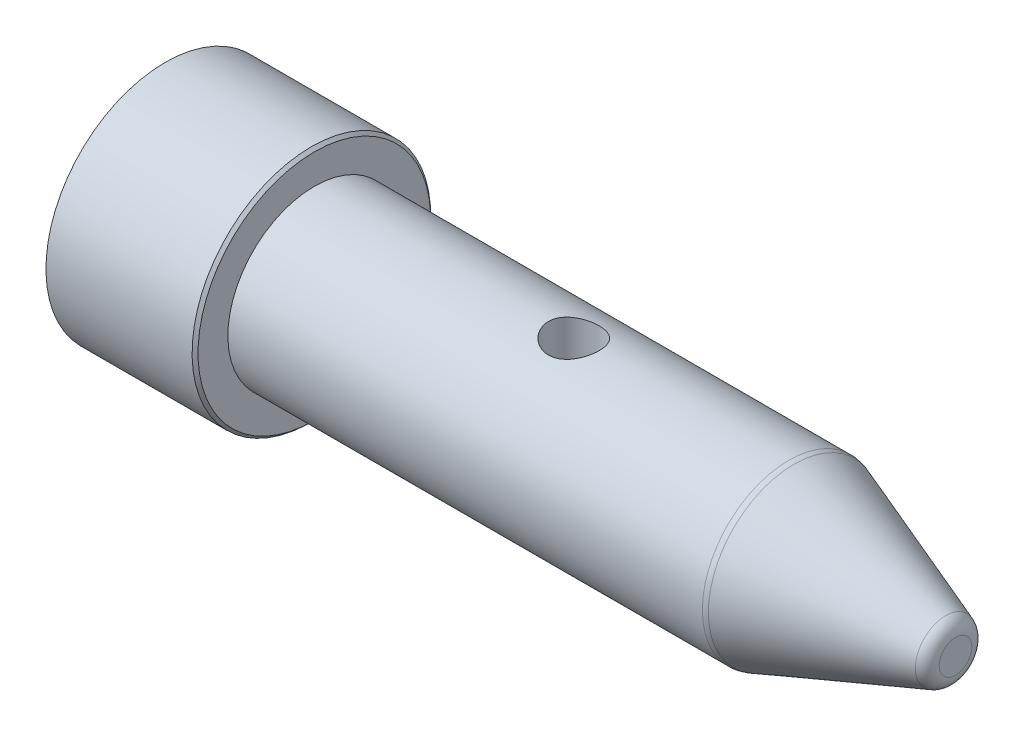
ISO-10303-21;
HEADER;
FILE_DESCRIPTION(('STEP AP214'),'2;1');
FILE_NAME('part.step','',(''),(''),'','','');
FILE_SCHEMA(('AUTOMOTIVE_DESIGN { 1 0 10303 214 1 1 1 1 }'));
ENDSEC;
DATA;
#1=APPLICATION_CONTEXT('core data for automotive mechanical design processes');
#2=APPLICATION_PROTOCOL_DEFINITION('international standard','automotive_design',2000,#1);
#3=PRODUCT_CONTEXT('',#1,'mechanical');
#4=PRODUCT('Part','Part','',(#3));
#5=PRODUCT_RELATED_PRODUCT_CATEGORY('part','',(#4));
#6=PRODUCT_DEFINITION_FORMATION('','',#4);
#7=PRODUCT_DEFINITION_CONTEXT('part definition',#1,'design');
#8=PRODUCT_DEFINITION('design','',#6,#7);
#9=PRODUCT_DEFINITION_SHAPE('','',#8);
#10=(LENGTH_UNIT() NAMED_UNIT(*) SI_UNIT(.MILLI.,.METRE.));
#11=(NAMED_UNIT(*) PLANE_ANGLE_UNIT() SI_UNIT($,.RADIAN.));
#12=(NAMED_UNIT(*) SI_UNIT($,.STERADIAN.) SOLID_ANGLE_UNIT());
#13=UNCERTAINTY_MEASURE_WITH_UNIT(LENGTH_MEASURE(1.E-05),#10,'distance_accuracy_value','');
#14=(GEOMETRIC_REPRESENTATION_CONTEXT(3) GLOBAL_UNCERTAINTY_ASSIGNED_CONTEXT((#13)) GLOBAL_UNIT_ASSIGNED_CONTEXT((#10,
#11,#12)) REPRESENTATION_CONTEXT('',''));
#15=CARTESIAN_POINT('',(0.,0.,0.));
#16=DIRECTION('',(0.,0.,1.));
#17=DIRECTION('',(1.,0.,0.));
#18=AXIS2_PLACEMENT_3D('',#15,#16,#17);
#19=CARTESIAN_POINT('',(0.,10.,0.));
#20=DIRECTION('',(-1.,0.,0.));
#21=DIRECTION('',(0.,-1.,0.));
#22=AXIS2_PLACEMENT_3D('',#19,#20,#21);
#23=PLANE('',#22);
#24=CARTESIAN_POINT('',(0.,0.,0.));
#25=DIRECTION('',(1.,0.,0.));
#26=DIRECTION('',(0.,1.,0.));
#27=AXIS2_PLACEMENT_3D('',#24,#25,#26);
#28=CIRCLE('',#27,10.);
#29=CARTESIAN_POINT('',(0.,10.,0.));
#30=VERTEX_POINT('',#29);
#31=EDGE_CURVE('E147',#30,#30,#28,.T.);
#32=ORIENTED_EDGE('',*,*,#31,.T.);
#33=EDGE_LOOP('',(#32));
#34=FACE_BOUND('',#33,.T.);
#35=CARTESIAN_POINT('',(0.,0.,0.));
#36=DIRECTION('',(1.,0.,0.));
#37=DIRECTION('',(0.,1.,0.));
#38=AXIS2_PLACEMENT_3D('',#35,#36,#37);
#39=CIRCLE('',#38,40.);
#40=CARTESIAN_POINT('',(0.,40.,0.));
#41=VERTEX_POINT('',#40);
#42=EDGE_CURVE('E138',#41,#41,#39,.T.);
#43=ORIENTED_EDGE('',*,*,#42,.F.);
#44=EDGE_LOOP('',(#43));
#45=FACE_BOUND('',#44,.T.);
#46=ADVANCED_FACE('F46',(#34,#45),#23,.T.);
#47=CARTESIAN_POINT('',(265.,0.,0.));
#48=DIRECTION('',(1.,0.,0.));
#49=DIRECTION('',(0.,1.,0.));
#50=AXIS2_PLACEMENT_3D('',#47,#48,#49);
#51=CYLINDRICAL_SURFACE('',#50,40.);
#52=CARTESIAN_POINT('',(49.,0.,0.));
#53=DIRECTION('',(1.,0.,0.));
#54=DIRECTION('',(0.,1.,0.));
#55=AXIS2_PLACEMENT_3D('',#52,#53,#54);
#56=CIRCLE('',#55,40.);
#57=CARTESIAN_POINT('',(49.,40.,0.));
#58=VERTEX_POINT('',#57);
#59=EDGE_CURVE('E129',#58,#58,#56,.F.);
#60=ORIENTED_EDGE('',*,*,#59,.T.);
#61=EDGE_LOOP('',(#60));
#62=FACE_BOUND('',#61,.T.);
#63=ORIENTED_EDGE('',*,*,#42,.T.);
#64=EDGE_LOOP('',(#63));
#65=FACE_BOUND('',#64,.T.);
#66=ADVANCED_FACE('F104',(#62,#65),#51,.T.);
#67=CARTESIAN_POINT('',(50.,39.9999999999999,0.));
#68=DIRECTION('',(1.,0.,0.));
#69=DIRECTION('',(0.,1.,0.));
#70=AXIS2_PLACEMENT_3D('',#67,#68,#69);
#71=PLANE('',#70);
#72=CARTESIAN_POINT('',(50.,-1.11022302462516E-13,0.));
#73=DIRECTION('',(1.,0.,0.));
#74=DIRECTION('',(0.,1.,0.));
#75=AXIS2_PLACEMENT_3D('',#72,#73,#74);
#76=CIRCLE('',#75,39.);
#77=CARTESIAN_POINT('',(50.,38.9999999999999,0.));
#78=VERTEX_POINT('',#77);
#79=EDGE_CURVE('E133',#78,#78,#76,.T.);
#80=ORIENTED_EDGE('',*,*,#79,.T.);
#81=EDGE_LOOP('',(#80));
#82=FACE_BOUND('',#81,.T.);
#83=CARTESIAN_POINT('',(50.,-1.11022302462516E-13,0.));
#84=DIRECTION('',(1.,0.,0.));
#85=DIRECTION('',(0.,1.,0.));
#86=AXIS2_PLACEMENT_3D('',#83,#84,#85);
#87=CIRCLE('',#86,29.);
#88=CARTESIAN_POINT('',(50.,28.9999999999999,0.));
#89=VERTEX_POINT('',#88);
#90=EDGE_CURVE('E141',#89,#89,#87,.T.);
#91=ORIENTED_EDGE('',*,*,#90,.F.);
#92=EDGE_LOOP('',(#91));
#93=FACE_BOUND('',#92,.T.);
#94=ADVANCED_FACE('F100',(#82,#93),#71,.T.);
#95=CARTESIAN_POINT('',(265.,0.,0.));
#96=DIRECTION('',(1.,0.,0.));
#97=DIRECTION('',(0.,1.,0.));
#98=AXIS2_PLACEMENT_3D('',#95,#96,#97);
#99=CYLINDRICAL_SURFACE('',#98,29.);
#100=CARTESIAN_POINT('',(128.5,28.9999999999999,0.));
#101=CARTESIAN_POINT('',(128.500000546186,28.9999996549336,0.233407123480568));
#102=CARTESIAN_POINT('',(128.509621873939,28.9971753703689,0.466824046245444));
#103=CARTESIAN_POINT('',(128.548021828591,28.9859552532089,0.931947947448221));
#104=CARTESIAN_POINT('',(128.576801526834,28.9775591090334,1.16365482952741));
#105=CARTESIAN_POINT('',(128.653264147547,28.9554254275635,1.62369206607447));
#106=CARTESIAN_POINT('',(128.700949025098,28.9416873378343,1.85202206878809));
#107=CARTESIAN_POINT('',(128.814827729385,28.9092384629732,2.30374308350369));
#108=CARTESIAN_POINT('',(128.88102840015,28.8905258392216,2.5271322362));
#109=CARTESIAN_POINT('',(129.031239513367,28.8486733555531,2.96694425489711));
#110=CARTESIAN_POINT('',(129.115216939276,28.825541710691,3.18337919019352));
#111=CARTESIAN_POINT('',(129.300425869486,28.775432144505,3.60836660488911));
#112=CARTESIAN_POINT('',(129.401663857023,28.7484527785644,3.81691608634153));
#113=CARTESIAN_POINT('',(129.620582018012,28.6913689363075,4.22465598495828));
#114=CARTESIAN_POINT('',(129.738256750982,28.6612654948888,4.42384946987775));
#115=CARTESIAN_POINT('',(129.98930618345,28.5986896202888,4.8118172750308));
#116=CARTESIAN_POINT('',(130.122688075951,28.566216104354,5.00058676307381));
#117=CARTESIAN_POINT('',(130.407720820393,28.498921004363,5.37101620833636));
#118=CARTESIAN_POINT('',(130.559742628774,28.4640611657005,5.55238385943118));
#119=CARTESIAN_POINT('',(130.87823082827,28.3936956565434,5.90167608201912));
#120=CARTESIAN_POINT('',(131.044691098134,28.3581902647314,6.06960629288614));
#121=CARTESIAN_POINT('',(131.391150457701,28.2874605880499,6.39114165796495));
#122=CARTESIAN_POINT('',(131.571157083712,28.2522364718976,6.54473873012392));
#123=CARTESIAN_POINT('',(131.943430316122,28.1830705387736,6.83644666622982));
#124=CARTESIAN_POINT('',(132.135692333141,28.1491282492804,6.97456327445029));
#125=CARTESIAN_POINT('',(132.535646553136,28.082747947805,7.23726659366598));
#126=CARTESIAN_POINT('',(132.743583516645,28.0503587553941,7.36149339856154));
#127=CARTESIAN_POINT('',(133.169600248517,27.9888828241316,7.59188090939718));
#128=CARTESIAN_POINT('',(133.387676017453,27.9597947984001,7.69804866332852));
#129=CARTESIAN_POINT('',(133.832553593136,27.9058054090053,7.89152199999591));
#130=CARTESIAN_POINT('',(134.059355633816,27.8809041576771,7.97882707664658));
#131=CARTESIAN_POINT('',(134.52004778386,27.8360848789715,8.13381183484407));
#132=CARTESIAN_POINT('',(134.753937653033,27.81616668294,8.20149218061242));
#133=CARTESIAN_POINT('',(135.220699589223,27.7824259716945,8.31506004139202));
#134=CARTESIAN_POINT('',(135.453430422735,27.7684541708684,8.36148381512638));
#135=CARTESIAN_POINT('',(135.922230127323,27.7462930369768,8.43473130768077));
#136=CARTESIAN_POINT('',(136.158298943669,27.7381036092131,8.46155534748715));
#137=CARTESIAN_POINT('',(136.631938518169,27.7277735171446,8.49534515358358));
#138=CARTESIAN_POINT('',(136.869508966852,27.7256316447788,8.50231488597677));
#139=CARTESIAN_POINT('',(137.344372985741,27.7274633589698,8.496339605202));
#140=CARTESIAN_POINT('',(137.581666561485,27.7314368210196,8.48339499748647));
#141=CARTESIAN_POINT('',(138.045996178192,27.745127785307,8.43850740039411));
#142=CARTESIAN_POINT('',(138.273103507491,27.7546422334803,8.40723577568916));
#143=CARTESIAN_POINT('',(138.723857455316,27.7789671847404,8.32650932197573));
#144=CARTESIAN_POINT('',(138.947502808986,27.793779577946,8.27704800335211));
#145=CARTESIAN_POINT('',(139.389654570401,27.8282568297051,8.1603808062212));
#146=CARTESIAN_POINT('',(139.608162525114,27.8479202064969,8.09318034580179));
#147=CARTESIAN_POINT('',(140.038758217144,27.8915425991625,7.94154092211577));
#148=CARTESIAN_POINT('',(140.250843497455,27.9155032352917,7.85709545505345));
#149=CARTESIAN_POINT('',(140.669842911701,27.9673733299231,7.67043197775387));
#150=CARTESIAN_POINT('',(140.876655925778,27.9953294646077,7.5680000478816));
#151=CARTESIAN_POINT('',(141.281022658023,28.0541818612825,7.34683418289115));
#152=CARTESIAN_POINT('',(141.47857316804,28.0850791308961,7.22809465462835));
#153=CARTESIAN_POINT('',(141.863155895833,28.1489666238407,6.97514786592083));
#154=CARTESIAN_POINT('',(142.050187867759,28.1819568960532,6.84094024416316));
#155=CARTESIAN_POINT('',(142.412625601819,28.2491556723137,6.55792292779995));
#156=CARTESIAN_POINT('',(142.588031049815,28.2833642092398,6.4091128389179));
#157=CARTESIAN_POINT('',(142.932941660012,28.3534857029891,6.09157802154538));
#158=CARTESIAN_POINT('',(143.101930499573,28.3894121204204,5.92229493930115));
#159=CARTESIAN_POINT('',(143.425054021001,28.4606128679971,5.57007900285313));
#160=CARTESIAN_POINT('',(143.579193500685,28.4958874057674,5.38715059156913));
#161=CARTESIAN_POINT('',(143.871707314151,28.5648410573415,5.00867872979229));
#162=CARTESIAN_POINT('',(144.010074749587,28.5985194693014,4.81312981748848));
#163=CARTESIAN_POINT('',(144.269932194798,28.6633229594507,4.41082820919168));
#164=CARTESIAN_POINT('',(144.391428810864,28.6944490351201,4.20407994298767));
#165=CARTESIAN_POINT('',(144.617437165209,28.7534931151095,3.77927427525336));
#166=CARTESIAN_POINT('',(144.721831625924,28.7813886126998,3.56115129248575));
#167=CARTESIAN_POINT('',(144.911769563166,28.8329280641793,3.11646159475602));
#168=CARTESIAN_POINT('',(144.997320640151,28.8565737315225,2.88989832744409));
#169=CARTESIAN_POINT('',(145.148885701692,28.898945305987,2.42987805600162));
#170=CARTESIAN_POINT('',(145.214899874197,28.9176712604369,2.19642111821356));
#171=CARTESIAN_POINT('',(145.326788248178,28.9496549775915,1.72436376015886));
#172=CARTESIAN_POINT('',(145.372663148826,28.9629129301266,1.485763518753));
#173=CARTESIAN_POINT('',(145.442615063159,28.9832135993502,1.0135340225873));
#174=CARTESIAN_POINT('',(145.467387633293,28.9904544299864,0.780016113203966));
#175=CARTESIAN_POINT('',(145.497526645988,28.9992715264576,0.311626455040997));
#176=CARTESIAN_POINT('',(145.502893533849,29.0008479222737,0.0767547374508936));
#177=CARTESIAN_POINT('',(145.494172747898,28.9982922626132,-0.392567679403727));
#178=CARTESIAN_POINT('',(145.480087311458,28.9941608636377,-0.627018423982383));
#179=CARTESIAN_POINT('',(145.432595290471,28.9803062127712,-1.09378580846319));
#180=CARTESIAN_POINT('',(145.399188832421,28.9705829974909,-1.32610246232743));
#181=CARTESIAN_POINT('',(145.314286008299,28.9460833449889,-1.78191688202809));
#182=CARTESIAN_POINT('',(145.263196357636,28.9314207023419,-2.00549672196439));
#183=CARTESIAN_POINT('',(145.143217679,28.8973819961682,-2.44754476285463));
#184=CARTESIAN_POINT('',(145.074322269979,28.8780042430335,-2.66601110061045));
#185=CARTESIAN_POINT('',(144.919313679258,28.8350479280364,-3.09624619387949));
#186=CARTESIAN_POINT('',(144.833205359804,28.8114705526738,-3.30801682125376));
#187=CARTESIAN_POINT('',(144.644376341534,28.7607061937744,-3.72365898809571));
#188=CARTESIAN_POINT('',(144.541649387741,28.7335178518225,-3.927527517391));
#189=CARTESIAN_POINT('',(144.317896060244,28.675593668049,-4.3304343586328));
#190=CARTESIAN_POINT('',(144.196515976863,28.6447927967032,-4.52926688871535));
#191=CARTESIAN_POINT('',(143.938001215657,28.5809407177656,-4.91612477827079));
#192=CARTESIAN_POINT('',(143.800861090193,28.5478887336686,-5.10414636692045));
#193=CARTESIAN_POINT('',(143.511764020521,28.4804023800766,-5.46817658795967));
#194=CARTESIAN_POINT('',(143.359806465932,28.4459679536683,-5.6441847249652));
#195=CARTESIAN_POINT('',(143.042041263077,28.3766140634962,-5.98311818269833));
#196=CARTESIAN_POINT('',(142.87623336542,28.3416945910079,-6.1460432677469));
#197=CARTESIAN_POINT('',(142.525787115753,28.271078147994,-6.46323878961647));
#198=CARTESIAN_POINT('',(142.340694384493,28.2353963820992,-6.61701106637589));
#199=CARTESIAN_POINT('',(141.958027483583,28.1655226894125,-6.90838459845248));
#200=CARTESIAN_POINT('',(141.760457569275,28.1313302613329,-7.0459913217233));
#201=CARTESIAN_POINT('',(141.353981065955,28.0654044454112,-7.30416576352272));
#202=CARTESIAN_POINT('',(141.145070261736,28.0336719826827,-7.4247270857321));
#203=CARTESIAN_POINT('',(140.717451506367,27.9736422587994,-7.64778934178577));
#204=CARTESIAN_POINT('',(140.498747613372,27.9453435924235,-7.75029767130664));
#205=CARTESIAN_POINT('',(140.053999350049,27.8931600732431,-7.93605016717663));
#206=CARTESIAN_POINT('',(139.827993778017,27.8692553363683,-8.01938157066215));
#207=CARTESIAN_POINT('',(139.369376857938,27.8264595932476,-8.16664136531243));
#208=CARTESIAN_POINT('',(139.136768134916,27.8075666246798,-8.23057735202569));
#209=CARTESIAN_POINT('',(138.666601045491,27.7753949473805,-8.338501767769));
#210=CARTESIAN_POINT('',(138.429043050463,27.7621158189887,-8.3824916878773));
#211=CARTESIAN_POINT('',(137.950790103046,27.7416102347007,-8.45010746263584));
#212=CARTESIAN_POINT('',(137.710095263506,27.7343835616726,-8.47373404782134));
#213=CARTESIAN_POINT('',(137.237074630177,27.7263867132954,-8.49986195563245));
#214=CARTESIAN_POINT('',(137.004796992219,27.7253710310693,-8.50316659116));
#215=CARTESIAN_POINT('',(136.540799192943,27.7291732628715,-8.49075929937917));
#216=CARTESIAN_POINT('',(136.309079024031,27.7339910969734,-8.47504763261763));
#217=CARTESIAN_POINT('',(135.847900706147,27.7493102081526,-8.4247534397304));
#218=CARTESIAN_POINT('',(135.618442445773,27.7598112038899,-8.39017184774322));
#219=CARTESIAN_POINT('',(135.163417170383,27.7861735972914,-8.30244845195464));
#220=CARTESIAN_POINT('',(134.937850174064,27.8020350207036,-8.24930655900175));
#221=CARTESIAN_POINT('',(134.494746318957,27.83842838932,-8.12563870016682));
#222=CARTESIAN_POINT('',(134.277146867189,27.8589043879952,-8.0553201885309));
#223=CARTESIAN_POINT('',(133.84862763173,27.9040450070428,-7.89753143020307));
#224=CARTESIAN_POINT('',(133.637710117237,27.928711032642,-7.81005542780483));
#225=CARTESIAN_POINT('',(133.223961465083,27.9815360850759,-7.61862784077982));
#226=CARTESIAN_POINT('',(133.021129948887,28.0096949481439,-7.51467702853489));
#227=CARTESIAN_POINT('',(132.624754295359,28.0687434222829,-7.29102288534986));
#228=CARTESIAN_POINT('',(132.431210696527,28.0996331913932,-7.17131864255206));
#229=CARTESIAN_POINT('',(132.047966477031,28.1644408249692,-6.91250170761517));
#230=CARTESIAN_POINT('',(131.858636536739,28.198426787151,-6.77285693825449));
#231=CARTESIAN_POINT('',(131.492315657005,28.267511788071,-6.47847434657095));
#232=CARTESIAN_POINT('',(131.31532495275,28.3026108480062,-6.3237362367045));
#233=CARTESIAN_POINT('',(130.974734837246,28.372980897627,-6.00011463390683));
#234=CARTESIAN_POINT('',(130.811138826484,28.4082519285773,-5.83122757088738));
#235=CARTESIAN_POINT('',(130.498426397509,28.4780129761215,-5.4803976525676));
#236=CARTESIAN_POINT('',(130.349309732225,28.5125030060346,-5.2984550201366));
#237=CARTESIAN_POINT('',(130.062606871881,28.5807189692741,-4.91741655067733));
#238=CARTESIAN_POINT('',(129.92545509714,28.6143971907376,-4.71798495464802));
#239=CARTESIAN_POINT('',(129.668527106794,28.6789998873273,-4.30790288358044));
#240=CARTESIAN_POINT('',(129.548744574823,28.7099253619084,-4.09725652510653));
#241=CARTESIAN_POINT('',(129.327451699819,28.768152539873,-3.66615515307947));
#242=CARTESIAN_POINT('',(129.225937046041,28.7954550977704,-3.4457024689184));
#243=CARTESIAN_POINT('',(129.041993348319,28.8456588234481,-2.99650103035319));
#244=CARTESIAN_POINT('',(128.959562303345,28.8685604526492,-2.76775314866165));
#245=CARTESIAN_POINT('',(128.823159182113,28.9068672912566,-2.33133657816601));
#246=CARTESIAN_POINT('',(128.766965063544,28.9228408962997,-2.12440912276008));
#247=CARTESIAN_POINT('',(128.670331692751,28.9504961315579,-1.70663006549185));
#248=CARTESIAN_POINT('',(128.629891460013,28.9621780288842,-1.49577870870722));
#249=CARTESIAN_POINT('',(128.565062792238,28.9809800019341,-1.07140601709728));
#250=CARTESIAN_POINT('',(128.54067538519,28.9880997855085,-0.857884512173156));
#251=CARTESIAN_POINT('',(128.508146461558,28.9976091502462,-0.429577805716462));
#252=CARTESIAN_POINT('',(128.499999497372,29.0000003175474,-0.214793052175163));
#253=CARTESIAN_POINT('',(128.5,28.9999999999999,0.));
#254=B_SPLINE_CURVE_WITH_KNOTS('',3,(#100,#101,#102,#103,#104,#105,#106,#107,#108,#109,#110,
#111,#112,#113,#114,#115,#116,#117,#118,#119,#120,#121,#122,#123,#124,#125,#126,#127,#128,#129,
#130,#131,#132,#133,#134,#135,#136,#137,#138,#139,#140,#141,#142,#143,#144,#145,#146,#147,#148,
#149,#150,#151,#152,#153,#154,#155,#156,#157,#158,#159,#160,#161,#162,#163,#164,#165,#166,#167,
#168,#169,#170,#171,#172,#173,#174,#175,#176,#177,#178,#179,#180,#181,#182,#183,#184,#185,#186,
#187,#188,#189,#190,#191,#192,#193,#194,#195,#196,#197,#198,#199,#200,#201,#202,#203,#204,#205,
#206,#207,#208,#209,#210,#211,#212,#213,#214,#215,#216,#217,#218,#219,#220,#221,#222,#223,#224,
#225,#226,#227,#228,#229,#230,#231,#232,#233,#234,#235,#236,#237,#238,#239,#240,#241,#242,#243,
#244,#245,#246,#247,#248,#249,#250,#251,#252,#253),.UNSPECIFIED.,.T.,.F.,(4,2,2,2,2,2,2,2,2,2,2,
2,2,2,2,2,2,2,2,2,2,2,2,2,2,2,2,2,2,2,2,2,2,2,2,2,2,2,2,2,2,2,2,2,2,2,2,2,2,2,2,2,2,2,2,2,2,2,2,
2,2,2,2,2,2,2,2,2,2,2,2,2,2,2,2,2,4),(0.,0.700023918254287,1.40008698536143,2.10022246842664,
2.8006170867045,3.4997221085801,4.19909030195856,4.89822755404779,5.59768622631641,
6.31448675889941,7.0309848721516,7.74788458761043,8.46451739907181,9.19674772170985,
9.92869161439936,10.6606551426959,11.3925938939551,12.1048835763169,12.8171615931944,
13.529297315194,14.2414185384291,14.9289532076528,15.6167334099179,16.3043037852049,
16.9921339518246,17.6887800936379,18.3856657691126,19.0825677261587,19.7794885052101,
20.5042743131419,21.2288251523043,21.9536916878371,22.6782735742244,23.4076332173444,
24.1366981330681,24.8657560347908,25.5947886239579,26.2987426617907,27.0026805459807,
27.7065374711585,28.4103897881304,29.0990249403974,29.7879072218439,30.4765951844,
31.1655429632747,31.8696897251975,32.5740806197774,33.2785005429378,33.9829331527239,
34.7118683719469,35.4405563165769,36.1695169810906,36.8981783178441,37.6234563429357,
38.3484499700503,39.0733893909617,39.7983028035663,40.4943664362234,41.1904205320564,
41.8864401734892,42.5824631581887,43.270462824792,43.9586936859125,44.6468922905239,
45.3351307477525,46.0474213282411,46.7597254812462,47.4722099085202,48.1846821759891,
48.9169118999178,49.6488746754408,50.3806644996203,51.1123775565068,51.7567900563888,
52.4011624419676,53.045576087828,53.6897735388539),.UNSPECIFIED.);
#255=CARTESIAN_POINT('',(128.5,28.9999999999999,0.));
#256=VERTEX_POINT('',#255);
#257=EDGE_CURVE('E50',#256,#256,#254,.T.);
#258=ORIENTED_EDGE('',*,*,#257,.F.);
#259=EDGE_LOOP('',(#258));
#260=FACE_BOUND('',#259,.T.);
#261=CARTESIAN_POINT('',(137.,-27.7263412660235,8.50000000000001));
#262=CARTESIAN_POINT('',(136.766835690033,-27.7263416674975,8.499999445582));
#263=CARTESIAN_POINT('',(136.533661526234,-27.7292904600116,8.49039796369948));
#264=CARTESIAN_POINT('',(136.069030112496,-27.7409941134422,8.45207910856824));
#265=CARTESIAN_POINT('',(135.83757296067,-27.7497493036046,8.42336065131079));
#266=CARTESIAN_POINT('',(135.378039157253,-27.7727940087849,8.34706522649548));
#267=CARTESIAN_POINT('',(135.149962949783,-27.7870842443151,8.29948580373463));
#268=CARTESIAN_POINT('',(134.698755650454,-27.8207671550728,8.18586717244828));
#269=CARTESIAN_POINT('',(134.475626433668,-27.8401617303416,8.11982108931489));
#270=CARTESIAN_POINT('',(134.036368367143,-27.8834257430689,7.96998310914069));
#271=CARTESIAN_POINT('',(133.820226304122,-27.9072860748605,7.88622727792752));
#272=CARTESIAN_POINT('',(133.395801460125,-27.9588242183095,7.70151536537277));
#273=CARTESIAN_POINT('',(133.1875216733,-27.986503465993,7.60055281041481));
#274=CARTESIAN_POINT('',(132.780276813426,-28.0448829276071,7.38222860209591));
#275=CARTESIAN_POINT('',(132.581308811642,-28.0755821821352,7.26487215183977));
#276=CARTESIAN_POINT('',(132.193734808843,-28.1391829618196,7.01448987206193));
#277=CARTESIAN_POINT('',(132.005133621952,-28.1720854946587,6.88145685134057));
#278=CARTESIAN_POINT('',(131.634505890967,-28.2401210297536,6.59678377118126));
#279=CARTESIAN_POINT('',(131.452800473684,-28.2752904294318,6.44473416508936));
#280=CARTESIAN_POINT('',(131.102827574325,-28.3460275469098,6.12611905308859));
#281=CARTESIAN_POINT('',(130.934554443597,-28.3815950900276,5.95955971121429));
#282=CARTESIAN_POINT('',(130.612343893977,-28.452195396082,5.61283239238379));
#283=CARTESIAN_POINT('',(130.458414110721,-28.4872278659714,5.43265725848333));
#284=CARTESIAN_POINT('',(130.166062416237,-28.5557789637942,5.05997691172557));
#285=CARTESIAN_POINT('',(130.027634700075,-28.5892981555674,4.86747635699667));
#286=CARTESIAN_POINT('',(129.764556763904,-28.6545820125239,4.4673080103496));
#287=CARTESIAN_POINT('',(129.640239625806,-28.6862978330583,4.25941304155855));
#288=CARTESIAN_POINT('',(129.409667833851,-28.7463171776573,3.83346858646245));
#289=CARTESIAN_POINT('',(129.303406135614,-28.7746220312611,3.61542310290503));
#290=CARTESIAN_POINT('',(129.109746079841,-28.8270257222246,3.17060490649912));
#291=CARTESIAN_POINT('',(129.022348575907,-28.8511243692448,2.94383179927403));
#292=CARTESIAN_POINT('',(128.867182763995,-28.8944139904292,2.48321155344978));
#293=CARTESIAN_POINT('',(128.799413818242,-28.9136051240474,2.24936464496726));
#294=CARTESIAN_POINT('',(128.685701332974,-28.9460649343587,1.7828336088779));
#295=CARTESIAN_POINT('',(128.639210964511,-28.9594813953444,1.55029298528734));
#296=CARTESIAN_POINT('',(128.565801397875,-28.9807603175422,1.08189056692629));
#297=CARTESIAN_POINT('',(128.538881875467,-28.988622870767,0.846028827243406));
#298=CARTESIAN_POINT('',(128.504866856772,-28.9985693104398,0.372799686638298));
#299=CARTESIAN_POINT('',(128.497767916184,-29.0006542008946,0.135432554500302));
#300=CARTESIAN_POINT('',(128.503451431781,-28.9989884157287,-0.339040864984552));
#301=CARTESIAN_POINT('',(128.516233540981,-28.9952378419548,-0.576147156811596));
#302=CARTESIAN_POINT('',(128.560861798023,-28.9822120963992,-1.04105733253651));
#303=CARTESIAN_POINT('',(128.592111676564,-28.9731097620505,-1.26892360577019));
#304=CARTESIAN_POINT('',(128.672920433802,-28.9497626655829,-1.72120176605096));
#305=CARTESIAN_POINT('',(128.722485863985,-28.935516063397,-1.94561238705133));
#306=CARTESIAN_POINT('',(128.839487677916,-28.9022632322912,-2.38927932654593));
#307=CARTESIAN_POINT('',(128.906918098494,-28.8832585916772,-2.60853733839602));
#308=CARTESIAN_POINT('',(129.059142764979,-28.8409755239568,-3.04060381536161));
#309=CARTESIAN_POINT('',(129.14394353561,-28.8176954912506,-3.2534098223644));
#310=CARTESIAN_POINT('',(129.331264674614,-28.7671910609248,-3.67341095973989));
#311=CARTESIAN_POINT('',(129.433968564457,-28.7399263375275,-3.88051935527116));
#312=CARTESIAN_POINT('',(129.655725794492,-28.6823447279115,-4.28543347942384));
#313=CARTESIAN_POINT('',(129.774784748327,-28.6520267946796,-4.48323598249966));
#314=CARTESIAN_POINT('',(130.028402694001,-28.5891252449044,-4.86826192977479));
#315=CARTESIAN_POINT('',(130.16296196284,-28.5565415878752,-5.0554851848268));
#316=CARTESIAN_POINT('',(130.446699453424,-28.4899409276158,-5.41823586421347));
#317=CARTESIAN_POINT('',(130.595878081526,-28.4559238845582,-5.59376296321481));
#318=CARTESIAN_POINT('',(130.913712031524,-28.3860527503104,-5.9383545110402));
#319=CARTESIAN_POINT('',(131.082884388774,-28.3501773081661,-6.10693810559301));
#320=CARTESIAN_POINT('',(131.434795368225,-28.2788230199223,-6.4292623491683));
#321=CARTESIAN_POINT('',(131.617529589683,-28.2433440494326,-6.58300777615512));
#322=CARTESIAN_POINT('',(131.995539708344,-28.1737484795936,-6.87476583625477));
#323=CARTESIAN_POINT('',(132.190821389991,-28.1396325205247,-7.01277113054228));
#324=CARTESIAN_POINT('',(132.592524275515,-28.0737708376894,-7.27195087892328));
#325=CARTESIAN_POINT('',(132.798941109021,-28.0420241954975,-7.39313187050737));
#326=CARTESIAN_POINT('',(133.223596728439,-27.9815413732195,-7.61886673991561));
#327=CARTESIAN_POINT('',(133.441927142151,-27.9528357275931,-7.72325659858101));
#328=CARTESIAN_POINT('',(133.887048723267,-27.8996714945267,-7.91315721684949));
#329=CARTESIAN_POINT('',(134.113836421397,-27.8752111883832,-7.99867562028734));
#330=CARTESIAN_POINT('',(134.574321978632,-27.8313024449634,-8.15014287572378));
#331=CARTESIAN_POINT('',(134.808019522468,-27.8118537794189,-8.21609261904898));
#332=CARTESIAN_POINT('',(135.280581330833,-27.7786044241961,-8.32781733947267));
#333=CARTESIAN_POINT('',(135.519445398578,-27.7648035198019,-8.37359308354923));
#334=CARTESIAN_POINT('',(135.991891012816,-27.7436946875691,-8.4432624093283));
#335=CARTESIAN_POINT('',(136.225356558362,-27.7361724761109,-8.46787909180727));
#336=CARTESIAN_POINT('',(136.693637538778,-27.7270457298723,-8.49771627759144));
#337=CARTESIAN_POINT('',(136.928452941489,-27.7254410546919,-8.50293724108167));
#338=CARTESIAN_POINT('',(137.397645722335,-27.7282003076067,-8.49393481414822));
#339=CARTESIAN_POINT('',(137.632023149757,-27.7325635178755,-8.47971376224016));
#340=CARTESIAN_POINT('',(138.098617693895,-27.7471185083761,-8.43196510977907));
#341=CARTESIAN_POINT('',(138.330834827143,-27.757310243973,-8.39843765707466));
#342=CARTESIAN_POINT('',(138.785712511132,-27.782880930663,-8.31344930776817));
#343=CARTESIAN_POINT('',(139.008467444138,-27.7981255635253,-8.26245173983066));
#344=CARTESIAN_POINT('',(139.448875553823,-27.8334114150692,-8.14279417132645));
#345=CARTESIAN_POINT('',(139.666526876014,-27.8534543485286,-8.07412785578788));
#346=CARTESIAN_POINT('',(140.095170788983,-27.8977533512528,-7.91970970808152));
#347=CARTESIAN_POINT('',(140.306165057264,-27.9220083489412,-7.83396222066018));
#348=CARTESIAN_POINT('',(140.720312182826,-27.9740682790084,-7.6459802083023));
#349=CARTESIAN_POINT('',(140.923462042735,-28.0018745511967,-7.54373945700813));
#350=CARTESIAN_POINT('',(141.325676642086,-28.061021055228,-7.32070618897851));
#351=CARTESIAN_POINT('',(141.524505612942,-28.0924332486839,-7.1995075464295));
#352=CARTESIAN_POINT('',(141.911391207197,-28.1573325178843,-6.94134996675271));
#353=CARTESIAN_POINT('',(142.099444069297,-28.1908203097092,-6.80438557632432));
#354=CARTESIAN_POINT('',(142.463576391863,-28.2589573805965,-6.51562188377898));
#355=CARTESIAN_POINT('',(142.639655455751,-28.2936066980725,-6.36382209071135));
#356=CARTESIAN_POINT('',(142.978770515545,-28.3631477276314,-6.04634220915125));
#357=CARTESIAN_POINT('',(143.141806303105,-28.3980394435764,-5.88066189902518));
#358=CARTESIAN_POINT('',(143.459454982128,-28.468398422021,-5.5302225453227));
#359=CARTESIAN_POINT('',(143.613552754482,-28.5038411268363,-5.34499117628158));
#360=CARTESIAN_POINT('',(143.905558682415,-28.5730050898918,-4.96197859970509));
#361=CARTESIAN_POINT('',(144.04347233484,-28.6067269304021,-4.76420168855916));
#362=CARTESIAN_POINT('',(144.302222292839,-28.671532072264,-4.35725903088041));
#363=CARTESIAN_POINT('',(144.423052510437,-28.702614431423,-4.14808926090675));
#364=CARTESIAN_POINT('',(144.64660220991,-28.7612393672456,-3.71991598956176));
#365=CARTESIAN_POINT('',(144.749329126943,-28.7887833958618,-3.50091657188505));
#366=CARTESIAN_POINT('',(144.935211945274,-28.8393766327277,-3.05615399996855));
#367=CARTESIAN_POINT('',(145.018505040996,-28.862457140123,-2.83045178145492));
#368=CARTESIAN_POINT('',(145.165733117601,-28.9037056611037,-2.37247386060684));
#369=CARTESIAN_POINT('',(145.229675619519,-28.9218755830016,-2.14020075067642));
#370=CARTESIAN_POINT('',(145.337667152593,-28.9527893971902,-1.67072478963668));
#371=CARTESIAN_POINT('',(145.381716818373,-28.9655334625763,-1.43352209604385));
#372=CARTESIAN_POINT('',(145.449510163357,-28.9852232340433,-0.955996326109833));
#373=CARTESIAN_POINT('',(145.473254485483,-28.99216912371,-0.715673348809887));
#374=CARTESIAN_POINT('',(145.499713781569,-28.9999135359195,-0.242672628441249));
#375=CARTESIAN_POINT('',(145.50317181384,-29.0009292650491,-0.0100396916394217));
#376=CARTESIAN_POINT('',(145.491012257667,-28.9973663328069,0.454683081132683));
#377=CARTESIAN_POINT('',(145.475394916934,-28.9927877440824,0.686772924116322));
#378=CARTESIAN_POINT('',(145.425226942413,-28.9781620431964,1.14870542438325));
#379=CARTESIAN_POINT('',(145.390677492192,-28.9681152728862,1.37854822122967));
#380=CARTESIAN_POINT('',(145.302950969321,-28.9428269678606,1.8343583738905));
#381=CARTESIAN_POINT('',(145.249773820244,-28.9275854118315,2.0603257138003));
#382=CARTESIAN_POINT('',(145.125873068528,-28.8924959663032,2.50456139859411));
#383=CARTESIAN_POINT('',(145.055331307596,-28.872695943888,2.72288431694838));
#384=CARTESIAN_POINT('',(144.89697539704,-28.8289165916465,3.15282081589574));
#385=CARTESIAN_POINT('',(144.809155437252,-28.8049358562761,3.36443211169034));
#386=CARTESIAN_POINT('',(144.616929693366,-28.7534180334097,3.77950920555822));
#387=CARTESIAN_POINT('',(144.51252505299,-28.7258811911769,3.98297556411751));
#388=CARTESIAN_POINT('',(144.287865687499,-28.6679474498312,4.38054247133667));
#389=CARTESIAN_POINT('',(144.167610073861,-28.6375503904169,4.57464249413478));
#390=CARTESIAN_POINT('',(143.908107885276,-28.5736882052182,4.95815423580503));
#391=CARTESIAN_POINT('',(143.768389277246,-28.5401572961377,5.14723570888694));
#392=CARTESIAN_POINT('',(143.473911384056,-28.4717583601985,5.51303976578065));
#393=CARTESIAN_POINT('',(143.319151845996,-28.4368903108631,5.68976214169927));
#394=CARTESIAN_POINT('',(142.995544574285,-28.3667341150893,6.02980491859617));
#395=CARTESIAN_POINT('',(142.826692951931,-28.3314458550125,6.19312159545519));
#396=CARTESIAN_POINT('',(142.475997160551,-28.2614053170468,6.50527185494543));
#397=CARTESIAN_POINT('',(142.294153179735,-28.2266530314025,6.65410564730664));
#398=CARTESIAN_POINT('',(141.91326331932,-28.1576650436464,6.94033043854946));
#399=CARTESIAN_POINT('',(141.713876084813,-28.1234718577245,7.07727789406624));
#400=CARTESIAN_POINT('',(141.303920708286,-28.0576696311581,7.33380606957411));
#401=CARTESIAN_POINT('',(141.093356660672,-28.0260596548361,7.45339309007221));
#402=CARTESIAN_POINT('',(140.662444455506,-27.96637243154,7.67431490055932));
#403=CARTESIAN_POINT('',(140.442098726603,-27.9382943142205,7.77565418994896));
#404=CARTESIAN_POINT('',(139.993116915492,-27.8865388727947,7.95927509627896));
#405=CARTESIAN_POINT('',(139.764481723298,-27.862861077901,8.04155875220053));
#406=CARTESIAN_POINT('',(139.328441820994,-27.8231973766183,8.17765755987992));
#407=CARTESIAN_POINT('',(139.121783544795,-27.8066292997383,8.2337044994364));
#408=CARTESIAN_POINT('',(138.704538511753,-27.7779075831796,8.33008913368462));
#409=CARTESIAN_POINT('',(138.493952012795,-27.7657536547799,8.37042785583363));
#410=CARTESIAN_POINT('',(138.070106837044,-27.7461765754234,8.43509511177791));
#411=CARTESIAN_POINT('',(137.856848053199,-27.7387536146117,8.45942300207422));
#412=CARTESIAN_POINT('',(137.429061993024,-27.7288366039012,8.49187297659123));
#413=CARTESIAN_POINT('',(137.214535167587,-27.7263408966262,8.50000051012165));
#414=CARTESIAN_POINT('',(137.,-27.7263412660235,8.50000000000001));
#415=B_SPLINE_CURVE_WITH_KNOTS('',3,(#261,#262,#263,#264,#265,#266,#267,#268,#269,#270,#271,
#272,#273,#274,#275,#276,#277,#278,#279,#280,#281,#282,#283,#284,#285,#286,#287,#288,#289,#290,
#291,#292,#293,#294,#295,#296,#297,#298,#299,#300,#301,#302,#303,#304,#305,#306,#307,#308,#309,
#310,#311,#312,#313,#314,#315,#316,#317,#318,#319,#320,#321,#322,#323,#324,#325,#326,#327,#328,
#329,#330,#331,#332,#333,#334,#335,#336,#337,#338,#339,#340,#341,#342,#343,#344,#345,#346,#347,
#348,#349,#350,#351,#352,#353,#354,#355,#356,#357,#358,#359,#360,#361,#362,#363,#364,#365,#366,
#367,#368,#369,#370,#371,#372,#373,#374,#375,#376,#377,#378,#379,#380,#381,#382,#383,#384,#385,
#386,#387,#388,#389,#390,#391,#392,#393,#394,#395,#396,#397,#398,#399,#400,#401,#402,#403,#404,
#405,#406,#407,#408,#409,#410,#411,#412,#413,#414),.UNSPECIFIED.,.T.,.F.,(4,2,2,2,2,2,2,2,2,2,2,
2,2,2,2,2,2,2,2,2,2,2,2,2,2,2,2,2,2,2,2,2,2,2,2,2,2,2,2,2,2,2,2,2,2,2,2,2,2,2,2,2,2,2,2,2,2,2,2,
2,2,2,2,2,2,2,2,2,2,2,2,2,2,2,2,2,4),(0.,0.699294720207063,1.39862909659117,2.09805453787789,
2.79774070266065,3.49601545181185,4.19455349235875,4.89287033204948,5.59150876177363,
6.30926456336988,7.02671692076188,7.74454905542351,8.46211148408717,9.19410537731002,
9.92581302203522,10.657553769468,11.3892707383105,12.1009511438631,12.8126197585928,
13.524164696185,14.2356972152785,14.9254231012305,15.6153959418822,16.3051387654535,
16.9951411497767,17.6926842591297,18.390467391242,19.0882629951353,19.7860780004001,
20.5097637716717,21.2332157295167,21.957003629194,22.6805094916439,23.4107020241048,
24.1405982488403,24.8704612226624,25.6002964460522,26.3040668156443,27.0078204873944,
27.7114895180137,28.4151531599993,29.1014392613629,29.7879709891802,30.4743283140728,
31.1609453540909,31.8650473430094,32.5693936136279,33.2737632012035,33.9781440377642,
34.7079035579213,35.4374144974577,36.1671847589979,36.8966545964565,37.6208073637181,
38.3446783105176,39.0685261627026,39.7923510950547,40.4894891953326,41.1866182427254,
41.8837037130724,42.5807920435259,43.2708698122902,43.9611800322829,44.6514426672965,
45.341744011301,46.0533776758187,46.7650233078961,47.4768659715845,48.1886983253802,
48.9206939054798,49.652423159572,50.3839717410683,51.1154420095704,51.7590979181643,
52.4027117188562,53.0463513857569,53.6897745151928),.UNSPECIFIED.);
#416=CARTESIAN_POINT('',(137.,-27.7263412660235,8.50000000000001));
#417=VERTEX_POINT('',#416);
#418=EDGE_CURVE('E67',#417,#417,#415,.T.);
#419=ORIENTED_EDGE('',*,*,#418,.F.);
#420=EDGE_LOOP('',(#419));
#421=FACE_BOUND('',#420,.T.);
#422=CARTESIAN_POINT('',(209.118365096458,-1.11022302462516E-13,0.));
#423=DIRECTION('',(-1.,0.,0.));
#424=DIRECTION('',(0.,-1.,0.));
#425=AXIS2_PLACEMENT_3D('',#422,#423,#424);
#426=CIRCLE('',#425,29.);
#427=CARTESIAN_POINT('',(209.118365096458,-29.0000000000001,0.));
#428=VERTEX_POINT('',#427);
#429=EDGE_CURVE('E12',#428,#428,#426,.T.);
#430=ORIENTED_EDGE('',*,*,#429,.T.);
#431=EDGE_LOOP('',(#430));
#432=FACE_BOUND('',#431,.T.);
#433=ORIENTED_EDGE('',*,*,#90,.T.);
#434=EDGE_LOOP('',(#433));
#435=FACE_BOUND('',#434,.T.);
#436=ADVANCED_FACE('F72',(#260,#421,#432,#435),#99,.T.);
#437=CARTESIAN_POINT('',(265.,0.,0.));
#438=DIRECTION('',(-1.,0.,0.));
#439=DIRECTION('',(0.,-1.,0.));
#440=AXIS2_PLACEMENT_3D('',#437,#438,#439);
#441=CONICAL_SURFACE('',#440,8.9816371153588,0.349065850398867);
#442=CARTESIAN_POINT('',(261.710100716628,0.,0.));
#443=DIRECTION('',(1.,0.,0.));
#444=DIRECTION('',(0.,1.,0.));
#445=AXIS2_PLACEMENT_3D('',#442,#443,#444);
#446=CIRCLE('',#445,10.1790625282398);
#447=CARTESIAN_POINT('',(261.710100716628,10.1790625282397,0.));
#448=VERTEX_POINT('',#447);
#449=EDGE_CURVE('E59',#448,#448,#446,.F.);
#450=ORIENTED_EDGE('',*,*,#449,.T.);
#451=EDGE_LOOP('',(#450));
#452=FACE_BOUND('',#451,.T.);
#453=CARTESIAN_POINT('',(210.828465813086,-1.11022302462516E-13,0.));
#454=DIRECTION('',(1.,0.,0.));
#455=DIRECTION('',(0.,1.,0.));
#456=AXIS2_PLACEMENT_3D('',#453,#454,#455);
#457=CIRCLE('',#456,28.6984631039295);
#458=CARTESIAN_POINT('',(210.828465813086,28.6984631039294,0.));
#459=VERTEX_POINT('',#458);
#460=EDGE_CURVE('E64',#459,#459,#457,.T.);
#461=ORIENTED_EDGE('',*,*,#460,.T.);
#462=EDGE_LOOP('',(#461));
#463=FACE_BOUND('',#462,.T.);
#464=ADVANCED_FACE('F93',(#452,#463),#441,.T.);
#465=CARTESIAN_POINT('',(265.,8.98163711535877,0.));
#466=DIRECTION('',(1.,0.,0.));
#467=DIRECTION('',(0.,1.,0.));
#468=AXIS2_PLACEMENT_3D('',#465,#466,#467);
#469=PLANE('',#468);
#470=CARTESIAN_POINT('',(265.,0.,0.));
#471=DIRECTION('',(1.,0.,0.));
#472=DIRECTION('',(0.,1.,0.));
#473=AXIS2_PLACEMENT_3D('',#470,#471,#472);
#474=CIRCLE('',#473,5.48059942431025);
#475=CARTESIAN_POINT('',(265.,5.48059942431025,0.));
#476=VERTEX_POINT('',#475);
#477=EDGE_CURVE('E128',#476,#476,#474,.T.);
#478=ORIENTED_EDGE('',*,*,#477,.T.);
#479=EDGE_LOOP('',(#478));
#480=FACE_BOUND('',#479,.T.);
#481=ADVANCED_FACE('F90',(#480),#469,.T.);
#482=CARTESIAN_POINT('',(-3.00000000000002,10.,0.));
#483=DIRECTION('',(-1.,0.,0.));
#484=DIRECTION('',(0.,-1.,0.));
#485=AXIS2_PLACEMENT_3D('',#482,#483,#484);
#486=PLANE('',#485);
#487=CARTESIAN_POINT('',(-3.,0.,0.));
#488=DIRECTION('',(1.,0.,0.));
#489=DIRECTION('',(0.,1.,0.));
#490=AXIS2_PLACEMENT_3D('',#487,#488,#489);
#491=CIRCLE('',#490,10.);
#492=CARTESIAN_POINT('',(-3.,10.,0.));
#493=VERTEX_POINT('',#492);
#494=EDGE_CURVE('E144',#493,#493,#491,.T.);
#495=ORIENTED_EDGE('',*,*,#494,.F.);
#496=EDGE_LOOP('',(#495));
#497=FACE_BOUND('',#496,.T.);
#498=ADVANCED_FACE('F86',(#497),#486,.T.);
#499=CARTESIAN_POINT('',(265.,0.,0.));
#500=DIRECTION('',(1.,0.,0.));
#501=DIRECTION('',(0.,1.,0.));
#502=AXIS2_PLACEMENT_3D('',#499,#500,#501);
#503=CYLINDRICAL_SURFACE('',#502,10.);
#504=ORIENTED_EDGE('',*,*,#494,.T.);
#505=EDGE_LOOP('',(#504));
#506=FACE_BOUND('',#505,.T.);
#507=ORIENTED_EDGE('',*,*,#31,.F.);
#508=EDGE_LOOP('',(#507));
#509=FACE_BOUND('',#508,.T.);
#510=ADVANCED_FACE('F81',(#506,#509),#503,.T.);
#511=CARTESIAN_POINT('',(50.,-1.11022302462516E-13,0.));
#512=DIRECTION('',(-1.,0.,0.));
#513=DIRECTION('',(0.,-1.,0.));
#514=AXIS2_PLACEMENT_3D('',#511,#512,#513);
#515=CONICAL_SURFACE('',#514,39.,0.785398163397414);
#516=ORIENTED_EDGE('',*,*,#59,.F.);
#517=EDGE_LOOP('',(#516));
#518=FACE_BOUND('',#517,.T.);
#519=ORIENTED_EDGE('',*,*,#79,.F.);
#520=EDGE_LOOP('',(#519));
#521=FACE_BOUND('',#520,.T.);
#522=ADVANCED_FACE('F85',(#518,#521),#515,.T.);
#523=CARTESIAN_POINT('',(260.,-1.11022302462516E-13,0.));
#524=DIRECTION('',(1.,0.,0.));
#525=DIRECTION('',(0.,1.,0.));
#526=AXIS2_PLACEMENT_3D('',#523,#524,#525);
#527=TOROIDAL_SURFACE('',#526,5.48059942431025,5.);
#528=ORIENTED_EDGE('',*,*,#449,.F.);
#529=EDGE_LOOP('',(#528));
#530=FACE_BOUND('',#529,.T.);
#531=ORIENTED_EDGE('',*,*,#477,.F.);
#532=EDGE_LOOP('',(#531));
#533=FACE_BOUND('',#532,.T.);
#534=ADVANCED_FACE('F116',(#530,#533),#527,.T.);
#535=CARTESIAN_POINT('',(209.118365096458,-1.11022302462516E-13,0.));
#536=DIRECTION('',(-1.,0.,0.));
#537=DIRECTION('',(0.,-1.,0.));
#538=AXIS2_PLACEMENT_3D('',#535,#536,#537);
#539=TOROIDAL_SURFACE('',#538,24.,5.);
#540=ORIENTED_EDGE('',*,*,#429,.F.);
#541=EDGE_LOOP('',(#540));
#542=FACE_BOUND('',#541,.T.);
#543=ORIENTED_EDGE('',*,*,#460,.F.);
#544=EDGE_LOOP('',(#543));
#545=FACE_BOUND('',#544,.T.);
#546=ADVANCED_FACE('F48',(#542,#545),#539,.T.);
#547=CARTESIAN_POINT('',(137.,-55.,0.));
#548=DIRECTION('',(0.,1.,0.));
#549=DIRECTION('',(0.,0.,1.));
#550=AXIS2_PLACEMENT_3D('',#547,#548,#549);
#551=CYLINDRICAL_SURFACE('',#550,8.50000000000001);
#552=ORIENTED_EDGE('',*,*,#257,.T.);
#553=EDGE_LOOP('',(#552));
#554=FACE_BOUND('',#553,.T.);
#555=ORIENTED_EDGE('',*,*,#418,.T.);
#556=EDGE_LOOP('',(#555));
#557=FACE_BOUND('',#556,.T.);
#558=ADVANCED_FACE('F76',(#554,#557),#551,.F.);
#559=CLOSED_SHELL('',(#46,#66,#94,#436,#464,#481,#498,#510,#522,#534,#546,#558));
#560=MANIFOLD_SOLID_BREP('B2',#559);
#561=ADVANCED_BREP_SHAPE_REPRESENTATION('',(#18,#560),#14);
#562=SHAPE_DEFINITION_REPRESENTATION(#9,#561);
ENDSEC;
END-ISO-10303-21;
